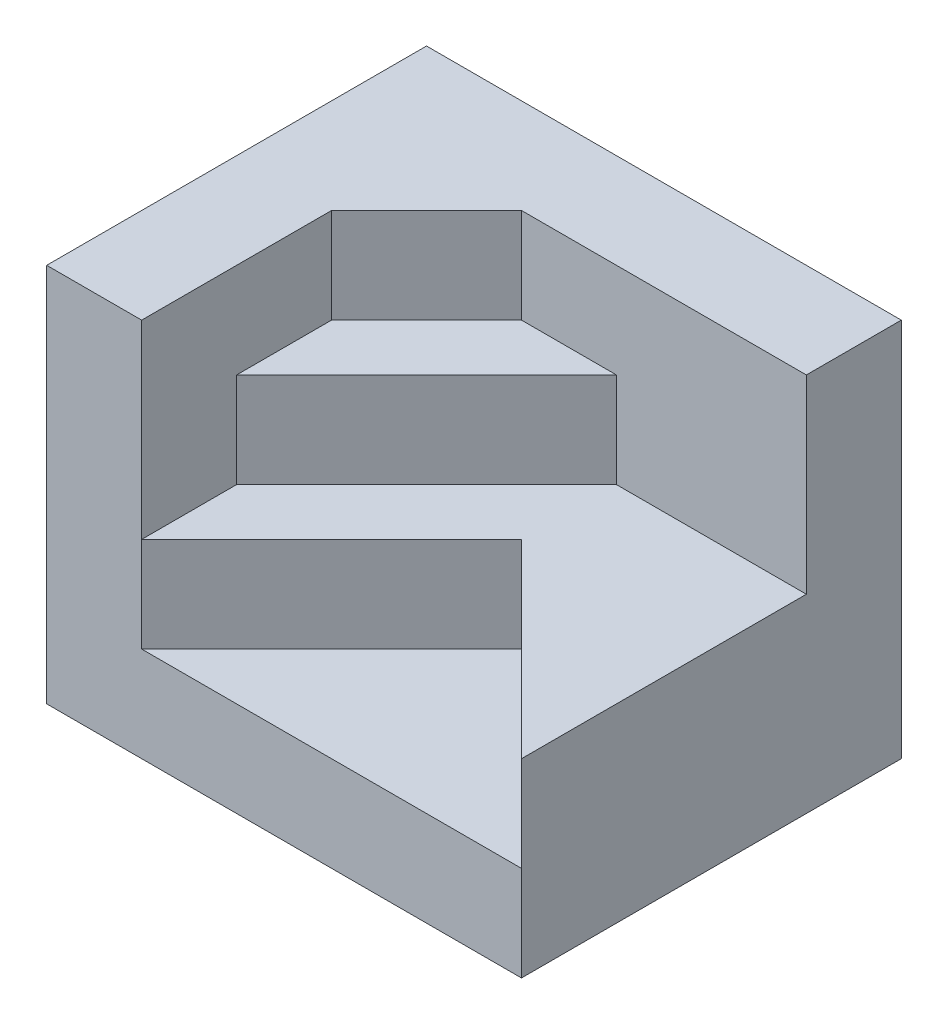
ISO-10303-21;
HEADER;
FILE_DESCRIPTION(('STEP AP214'),'2;1');
FILE_NAME('part.step','',(''),(''),'','','');
FILE_SCHEMA(('AUTOMOTIVE_DESIGN { 1 0 10303 214 1 1 1 1 }'));
ENDSEC;
DATA;
#1=APPLICATION_CONTEXT('core data for automotive mechanical design processes');
#2=APPLICATION_PROTOCOL_DEFINITION('international standard','automotive_design',2000,#1);
#3=PRODUCT_CONTEXT('',#1,'mechanical');
#4=PRODUCT('Part','Part','',(#3));
#5=PRODUCT_RELATED_PRODUCT_CATEGORY('part','',(#4));
#6=PRODUCT_DEFINITION_FORMATION('','',#4);
#7=PRODUCT_DEFINITION_CONTEXT('part definition',#1,'design');
#8=PRODUCT_DEFINITION('design','',#6,#7);
#9=PRODUCT_DEFINITION_SHAPE('','',#8);
#10=(LENGTH_UNIT() NAMED_UNIT(*) SI_UNIT(.MILLI.,.METRE.));
#11=(NAMED_UNIT(*) PLANE_ANGLE_UNIT() SI_UNIT($,.RADIAN.));
#12=(NAMED_UNIT(*) SI_UNIT($,.STERADIAN.) SOLID_ANGLE_UNIT());
#13=UNCERTAINTY_MEASURE_WITH_UNIT(LENGTH_MEASURE(1.E-05),#10,'distance_accuracy_value','');
#14=(GEOMETRIC_REPRESENTATION_CONTEXT(3) GLOBAL_UNCERTAINTY_ASSIGNED_CONTEXT((#13)) GLOBAL_UNIT_ASSIGNED_CONTEXT((#10,
#11,#12)) REPRESENTATION_CONTEXT('',''));
#15=CARTESIAN_POINT('',(0.,0.,0.));
#16=DIRECTION('',(0.,0.,1.));
#17=DIRECTION('',(1.,0.,0.));
#18=AXIS2_PLACEMENT_3D('',#15,#16,#17);
#19=CARTESIAN_POINT('',(-15.,184.372930440884,0.));
#20=DIRECTION('',(1.,0.,0.));
#21=DIRECTION('',(0.,0.,-1.));
#22=AXIS2_PLACEMENT_3D('',#19,#20,#21);
#23=PLANE('',#22);
#24=DIRECTION('',(0.,0.,-1.));
#25=VECTOR('',#24,1.);
#26=CARTESIAN_POINT('',(-15.,20.,0.));
#27=LINE('',#26,#25);
#28=CARTESIAN_POINT('',(-15.,20.,20.));
#29=VERTEX_POINT('',#28);
#30=CARTESIAN_POINT('',(-15.,20.,10.));
#31=VERTEX_POINT('',#30);
#32=EDGE_CURVE('E130',#29,#31,#27,.T.);
#33=ORIENTED_EDGE('',*,*,#32,.T.);
#34=DIRECTION('',(0.,-1.,0.));
#35=VECTOR('',#34,1.);
#36=CARTESIAN_POINT('',(-15.,30.,10.));
#37=LINE('',#36,#35);
#38=CARTESIAN_POINT('',(-15.,30.,10.));
#39=VERTEX_POINT('',#38);
#40=EDGE_CURVE('E47',#39,#31,#37,.T.);
#41=ORIENTED_EDGE('',*,*,#40,.F.);
#42=DIRECTION('',(0.,0.,-1.));
#43=VECTOR('',#42,1.);
#44=CARTESIAN_POINT('',(-15.,30.,10.));
#45=LINE('',#44,#43);
#46=CARTESIAN_POINT('',(-15.,30.,0.));
#47=VERTEX_POINT('',#46);
#48=EDGE_CURVE('E52',#39,#47,#45,.T.);
#49=ORIENTED_EDGE('',*,*,#48,.T.);
#50=DIRECTION('',(0.,-1.,0.));
#51=VECTOR('',#50,1.);
#52=CARTESIAN_POINT('',(-15.,184.372930440884,0.));
#53=LINE('',#52,#51);
#54=CARTESIAN_POINT('',(-15.,40.,0.));
#55=VERTEX_POINT('',#54);
#56=EDGE_CURVE('E167',#55,#47,#53,.T.);
#57=ORIENTED_EDGE('',*,*,#56,.F.);
#58=DIRECTION('',(0.,0.,-1.));
#59=VECTOR('',#58,1.);
#60=CARTESIAN_POINT('',(-15.,40.,0.));
#61=LINE('',#60,#59);
#62=CARTESIAN_POINT('',(-15.,40.,20.));
#63=VERTEX_POINT('',#62);
#64=EDGE_CURVE('E153',#63,#55,#61,.T.);
#65=ORIENTED_EDGE('',*,*,#64,.F.);
#66=DIRECTION('',(0.,-1.,0.));
#67=VECTOR('',#66,1.);
#68=CARTESIAN_POINT('',(-15.,184.372930440884,20.));
#69=LINE('',#68,#67);
#70=EDGE_CURVE('E164',#63,#29,#69,.T.);
#71=ORIENTED_EDGE('',*,*,#70,.T.);
#72=EDGE_LOOP('',(#33,#41,#49,#57,#65,#71));
#73=FACE_BOUND('',#72,.T.);
#74=ADVANCED_FACE('F32',(#73),#23,.T.);
#75=CARTESIAN_POINT('',(-5.00000000000001,184.372930440884,-10.));
#76=DIRECTION('',(0.707106781186548,0.,0.707106781186547));
#77=DIRECTION('',(0.707106781186547,0.,-0.707106781186548));
#78=AXIS2_PLACEMENT_3D('',#75,#76,#77);
#79=PLANE('',#78);
#80=ORIENTED_EDGE('',*,*,#56,.T.);
#81=DIRECTION('',(0.707106781186547,0.,-0.707106781186548));
#82=VECTOR('',#81,1.);
#83=CARTESIAN_POINT('',(-15.,30.,0.));
#84=LINE('',#83,#82);
#85=CARTESIAN_POINT('',(-5.00000000000001,30.,-10.));
#86=VERTEX_POINT('',#85);
#87=EDGE_CURVE('E252',#47,#86,#84,.T.);
#88=ORIENTED_EDGE('',*,*,#87,.T.);
#89=DIRECTION('',(0.,-1.,0.));
#90=VECTOR('',#89,1.);
#91=CARTESIAN_POINT('',(-5.00000000000001,184.372930440884,-10.));
#92=LINE('',#91,#90);
#93=CARTESIAN_POINT('',(-5.00000000000001,40.,-10.));
#94=VERTEX_POINT('',#93);
#95=EDGE_CURVE('E162',#94,#86,#92,.T.);
#96=ORIENTED_EDGE('',*,*,#95,.F.);
#97=DIRECTION('',(0.707106781186547,0.,-0.707106781186548));
#98=VECTOR('',#97,1.);
#99=CARTESIAN_POINT('',(-5.00000000000001,40.,-10.));
#100=LINE('',#99,#98);
#101=EDGE_CURVE('E156',#55,#94,#100,.T.);
#102=ORIENTED_EDGE('',*,*,#101,.F.);
#103=EDGE_LOOP('',(#80,#88,#96,#102));
#104=FACE_BOUND('',#103,.T.);
#105=ADVANCED_FACE('F250',(#104),#79,.T.);
#106=CARTESIAN_POINT('',(25.,184.372930440884,-10.));
#107=DIRECTION('',(0.,0.,1.));
#108=DIRECTION('',(1.,0.,0.));
#109=AXIS2_PLACEMENT_3D('',#106,#107,#108);
#110=PLANE('',#109);
#111=DIRECTION('',(1.,0.,0.));
#112=VECTOR('',#111,1.);
#113=CARTESIAN_POINT('',(-5.00000000000001,30.,-10.));
#114=LINE('',#113,#112);
#115=CARTESIAN_POINT('',(4.99999999999999,30.,-10.));
#116=VERTEX_POINT('',#115);
#117=EDGE_CURVE('E138',#86,#116,#114,.T.);
#118=ORIENTED_EDGE('',*,*,#117,.T.);
#119=DIRECTION('',(0.,-1.,0.));
#120=VECTOR('',#119,1.);
#121=CARTESIAN_POINT('',(4.99999999999999,30.,-10.));
#122=LINE('',#121,#120);
#123=CARTESIAN_POINT('',(4.99999999999999,20.,-10.));
#124=VERTEX_POINT('',#123);
#125=EDGE_CURVE('E134',#116,#124,#122,.T.);
#126=ORIENTED_EDGE('',*,*,#125,.T.);
#127=DIRECTION('',(1.,0.,0.));
#128=VECTOR('',#127,1.);
#129=CARTESIAN_POINT('',(25.,20.,-10.));
#130=LINE('',#129,#128);
#131=CARTESIAN_POINT('',(25.,20.,-10.));
#132=VERTEX_POINT('',#131);
#133=EDGE_CURVE('E121',#124,#132,#130,.T.);
#134=ORIENTED_EDGE('',*,*,#133,.T.);
#135=DIRECTION('',(0.,-1.,0.));
#136=VECTOR('',#135,1.);
#137=CARTESIAN_POINT('',(25.,184.372930440884,-10.));
#138=LINE('',#137,#136);
#139=CARTESIAN_POINT('',(25.,40.,-10.));
#140=VERTEX_POINT('',#139);
#141=EDGE_CURVE('E151',#140,#132,#138,.T.);
#142=ORIENTED_EDGE('',*,*,#141,.F.);
#143=DIRECTION('',(1.,0.,0.));
#144=VECTOR('',#143,1.);
#145=CARTESIAN_POINT('',(25.,40.,-10.));
#146=LINE('',#145,#144);
#147=EDGE_CURVE('E131',#94,#140,#146,.T.);
#148=ORIENTED_EDGE('',*,*,#147,.F.);
#149=ORIENTED_EDGE('',*,*,#95,.T.);
#150=EDGE_LOOP('',(#118,#126,#134,#142,#148,#149));
#151=FACE_BOUND('',#150,.T.);
#152=ADVANCED_FACE('F135',(#151),#110,.T.);
#153=CARTESIAN_POINT('',(0.,20.,0.));
#154=DIRECTION('',(0.,-1.,0.));
#155=DIRECTION('',(0.,0.,-1.));
#156=AXIS2_PLACEMENT_3D('',#153,#154,#155);
#157=PLANE('',#156);
#158=DIRECTION('',(0.707106781186548,0.,-0.707106781186547));
#159=VECTOR('',#158,1.);
#160=CARTESIAN_POINT('',(-15.,20.,10.));
#161=LINE('',#160,#159);
#162=EDGE_CURVE('E125',#31,#124,#161,.T.);
#163=ORIENTED_EDGE('',*,*,#162,.F.);
#164=ORIENTED_EDGE('',*,*,#32,.F.);
#165=DIRECTION('',(-0.707106781186548,0.,0.707106781186548));
#166=VECTOR('',#165,1.);
#167=CARTESIAN_POINT('',(4.99999999999999,20.,0.));
#168=LINE('',#167,#166);
#169=CARTESIAN_POINT('',(4.99999999999999,20.,0.));
#170=VERTEX_POINT('',#169);
#171=EDGE_CURVE('E141',#170,#29,#168,.T.);
#172=ORIENTED_EDGE('',*,*,#171,.F.);
#173=DIRECTION('',(-0.707106781186548,0.,-0.707106781186547));
#174=VECTOR('',#173,1.);
#175=CARTESIAN_POINT('',(25.,20.,20.));
#176=LINE('',#175,#174);
#177=CARTESIAN_POINT('',(25.,20.,20.));
#178=VERTEX_POINT('',#177);
#179=EDGE_CURVE('E172',#178,#170,#176,.T.);
#180=ORIENTED_EDGE('',*,*,#179,.F.);
#181=DIRECTION('',(0.,0.,-1.));
#182=VECTOR('',#181,1.);
#183=CARTESIAN_POINT('',(25.,20.,20.));
#184=LINE('',#183,#182);
#185=EDGE_CURVE('E127',#178,#132,#184,.T.);
#186=ORIENTED_EDGE('',*,*,#185,.T.);
#187=ORIENTED_EDGE('',*,*,#133,.F.);
#188=EDGE_LOOP('',(#163,#164,#172,#180,#186,#187));
#189=FACE_BOUND('',#188,.T.);
#190=ADVANCED_FACE('F123',(#189),#157,.F.);
#191=CARTESIAN_POINT('',(25.,40.,20.));
#192=DIRECTION('',(-1.,0.,0.));
#193=DIRECTION('',(0.,0.,1.));
#194=AXIS2_PLACEMENT_3D('',#191,#192,#193);
#195=PLANE('',#194);
#196=ORIENTED_EDGE('',*,*,#141,.T.);
#197=ORIENTED_EDGE('',*,*,#185,.F.);
#198=DIRECTION('',(0.,-1.,0.));
#199=VECTOR('',#198,1.);
#200=CARTESIAN_POINT('',(25.,40.,20.));
#201=LINE('',#200,#199);
#202=CARTESIAN_POINT('',(25.,10.,20.));
#203=VERTEX_POINT('',#202);
#204=EDGE_CURVE('E210',#178,#203,#201,.T.);
#205=ORIENTED_EDGE('',*,*,#204,.T.);
#206=CARTESIAN_POINT('',(25.,0.,20.));
#207=VERTEX_POINT('',#206);
#208=EDGE_CURVE('E201',#203,#207,#201,.T.);
#209=ORIENTED_EDGE('',*,*,#208,.T.);
#210=DIRECTION('',(0.,0.,-1.));
#211=VECTOR('',#210,1.);
#212=CARTESIAN_POINT('',(25.,0.,20.));
#213=LINE('',#212,#211);
#214=CARTESIAN_POINT('',(25.,0.,-20.));
#215=VERTEX_POINT('',#214);
#216=EDGE_CURVE('E188',#207,#215,#213,.T.);
#217=ORIENTED_EDGE('',*,*,#216,.T.);
#218=DIRECTION('',(0.,-1.,0.));
#219=VECTOR('',#218,1.);
#220=CARTESIAN_POINT('',(25.,40.,-20.));
#221=LINE('',#220,#219);
#222=CARTESIAN_POINT('',(25.,40.,-20.));
#223=VERTEX_POINT('',#222);
#224=EDGE_CURVE('E11',#223,#215,#221,.T.);
#225=ORIENTED_EDGE('',*,*,#224,.F.);
#226=DIRECTION('',(0.,0.,-1.));
#227=VECTOR('',#226,1.);
#228=CARTESIAN_POINT('',(25.,40.,20.));
#229=LINE('',#228,#227);
#230=EDGE_CURVE('E191',#140,#223,#229,.T.);
#231=ORIENTED_EDGE('',*,*,#230,.F.);
#232=EDGE_LOOP('',(#196,#197,#205,#209,#217,#225,#231));
#233=FACE_BOUND('',#232,.T.);
#234=ADVANCED_FACE('F34',(#233),#195,.F.);
#235=CARTESIAN_POINT('',(0.,40.,0.));
#236=DIRECTION('',(0.,-1.,0.));
#237=DIRECTION('',(0.,0.,-1.));
#238=AXIS2_PLACEMENT_3D('',#235,#236,#237);
#239=PLANE('',#238);
#240=ORIENTED_EDGE('',*,*,#64,.T.);
#241=ORIENTED_EDGE('',*,*,#101,.T.);
#242=ORIENTED_EDGE('',*,*,#147,.T.);
#243=ORIENTED_EDGE('',*,*,#230,.T.);
#244=DIRECTION('',(-1.,0.,0.));
#245=VECTOR('',#244,1.);
#246=CARTESIAN_POINT('',(-25.,40.,-20.));
#247=LINE('',#246,#245);
#248=CARTESIAN_POINT('',(-25.,40.,-20.));
#249=VERTEX_POINT('',#248);
#250=EDGE_CURVE('E193',#223,#249,#247,.T.);
#251=ORIENTED_EDGE('',*,*,#250,.T.);
#252=DIRECTION('',(0.,0.,1.));
#253=VECTOR('',#252,1.);
#254=CARTESIAN_POINT('',(-25.,40.,20.));
#255=LINE('',#254,#253);
#256=CARTESIAN_POINT('',(-25.,40.,20.));
#257=VERTEX_POINT('',#256);
#258=EDGE_CURVE('E196',#249,#257,#255,.T.);
#259=ORIENTED_EDGE('',*,*,#258,.T.);
#260=DIRECTION('',(1.,0.,0.));
#261=VECTOR('',#260,1.);
#262=CARTESIAN_POINT('',(-25.,40.,20.));
#263=LINE('',#262,#261);
#264=EDGE_CURVE('E198',#257,#63,#263,.T.);
#265=ORIENTED_EDGE('',*,*,#264,.T.);
#266=EDGE_LOOP('',(#240,#241,#242,#243,#251,#259,#265));
#267=FACE_BOUND('',#266,.T.);
#268=ADVANCED_FACE('F234',(#267),#239,.F.);
#269=CARTESIAN_POINT('',(-25.,40.,-20.));
#270=DIRECTION('',(0.,0.,1.));
#271=DIRECTION('',(1.,0.,0.));
#272=AXIS2_PLACEMENT_3D('',#269,#270,#271);
#273=PLANE('',#272);
#274=DIRECTION('',(-1.,0.,0.));
#275=VECTOR('',#274,1.);
#276=CARTESIAN_POINT('',(-25.,0.,-20.));
#277=LINE('',#276,#275);
#278=CARTESIAN_POINT('',(-25.,0.,-20.));
#279=VERTEX_POINT('',#278);
#280=EDGE_CURVE('E204',#215,#279,#277,.T.);
#281=ORIENTED_EDGE('',*,*,#280,.T.);
#282=DIRECTION('',(0.,-1.,0.));
#283=VECTOR('',#282,1.);
#284=CARTESIAN_POINT('',(-25.,40.,-20.));
#285=LINE('',#284,#283);
#286=EDGE_CURVE('E40',#249,#279,#285,.T.);
#287=ORIENTED_EDGE('',*,*,#286,.F.);
#288=ORIENTED_EDGE('',*,*,#250,.F.);
#289=ORIENTED_EDGE('',*,*,#224,.T.);
#290=EDGE_LOOP('',(#281,#287,#288,#289));
#291=FACE_BOUND('',#290,.T.);
#292=ADVANCED_FACE('F237',(#291),#273,.F.);
#293=CARTESIAN_POINT('',(-25.,40.,20.));
#294=DIRECTION('',(1.,0.,0.));
#295=DIRECTION('',(0.,0.,-1.));
#296=AXIS2_PLACEMENT_3D('',#293,#294,#295);
#297=PLANE('',#296);
#298=DIRECTION('',(0.,0.,1.));
#299=VECTOR('',#298,1.);
#300=CARTESIAN_POINT('',(-25.,0.,20.));
#301=LINE('',#300,#299);
#302=CARTESIAN_POINT('',(-25.,0.,20.));
#303=VERTEX_POINT('',#302);
#304=EDGE_CURVE('E206',#279,#303,#301,.T.);
#305=ORIENTED_EDGE('',*,*,#304,.T.);
#306=DIRECTION('',(0.,-1.,0.));
#307=VECTOR('',#306,1.);
#308=CARTESIAN_POINT('',(-25.,40.,20.));
#309=LINE('',#308,#307);
#310=EDGE_CURVE('E212',#257,#303,#309,.T.);
#311=ORIENTED_EDGE('',*,*,#310,.F.);
#312=ORIENTED_EDGE('',*,*,#258,.F.);
#313=ORIENTED_EDGE('',*,*,#286,.T.);
#314=EDGE_LOOP('',(#305,#311,#312,#313));
#315=FACE_BOUND('',#314,.T.);
#316=ADVANCED_FACE('F219',(#315),#297,.F.);
#317=CARTESIAN_POINT('',(-25.,40.,20.));
#318=DIRECTION('',(0.,0.,-1.));
#319=DIRECTION('',(-1.,0.,0.));
#320=AXIS2_PLACEMENT_3D('',#317,#318,#319);
#321=PLANE('',#320);
#322=DIRECTION('',(1.,0.,0.));
#323=VECTOR('',#322,1.);
#324=CARTESIAN_POINT('',(-15.,10.,20.));
#325=LINE('',#324,#323);
#326=CARTESIAN_POINT('',(-15.,10.,20.));
#327=VERTEX_POINT('',#326);
#328=EDGE_CURVE('E169',#327,#203,#325,.T.);
#329=ORIENTED_EDGE('',*,*,#328,.F.);
#330=DIRECTION('',(0.,1.,0.));
#331=VECTOR('',#330,1.);
#332=CARTESIAN_POINT('',(-15.,10.,20.));
#333=LINE('',#332,#331);
#334=EDGE_CURVE('E185',#327,#29,#333,.T.);
#335=ORIENTED_EDGE('',*,*,#334,.T.);
#336=ORIENTED_EDGE('',*,*,#70,.F.);
#337=ORIENTED_EDGE('',*,*,#264,.F.);
#338=ORIENTED_EDGE('',*,*,#310,.T.);
#339=DIRECTION('',(1.,0.,0.));
#340=VECTOR('',#339,1.);
#341=CARTESIAN_POINT('',(-25.,0.,20.));
#342=LINE('',#341,#340);
#343=EDGE_CURVE('E194',#303,#207,#342,.T.);
#344=ORIENTED_EDGE('',*,*,#343,.T.);
#345=ORIENTED_EDGE('',*,*,#208,.F.);
#346=EDGE_LOOP('',(#329,#335,#336,#337,#338,#344,#345));
#347=FACE_BOUND('',#346,.T.);
#348=ADVANCED_FACE('F230',(#347),#321,.F.);
#349=CARTESIAN_POINT('',(0.,0.,0.));
#350=DIRECTION('',(0.,-1.,0.));
#351=DIRECTION('',(0.,0.,-1.));
#352=AXIS2_PLACEMENT_3D('',#349,#350,#351);
#353=PLANE('',#352);
#354=ORIENTED_EDGE('',*,*,#216,.F.);
#355=ORIENTED_EDGE('',*,*,#343,.F.);
#356=ORIENTED_EDGE('',*,*,#304,.F.);
#357=ORIENTED_EDGE('',*,*,#280,.F.);
#358=EDGE_LOOP('',(#354,#355,#356,#357));
#359=FACE_BOUND('',#358,.T.);
#360=ADVANCED_FACE('F226',(#359),#353,.T.);
#361=CARTESIAN_POINT('',(4.99999999999999,10.,0.));
#362=DIRECTION('',(-0.707106781186547,0.,-0.707106781186547));
#363=DIRECTION('',(-0.707106781186548,0.,0.707106781186548));
#364=AXIS2_PLACEMENT_3D('',#361,#362,#363);
#365=PLANE('',#364);
#366=DIRECTION('',(0.,1.,0.));
#367=VECTOR('',#366,1.);
#368=CARTESIAN_POINT('',(4.99999999999999,10.,0.));
#369=LINE('',#368,#367);
#370=CARTESIAN_POINT('',(4.99999999999999,10.,0.));
#371=VERTEX_POINT('',#370);
#372=EDGE_CURVE('E184',#371,#170,#369,.T.);
#373=ORIENTED_EDGE('',*,*,#372,.T.);
#374=ORIENTED_EDGE('',*,*,#171,.T.);
#375=ORIENTED_EDGE('',*,*,#334,.F.);
#376=DIRECTION('',(-0.707106781186548,0.,0.707106781186548));
#377=VECTOR('',#376,1.);
#378=CARTESIAN_POINT('',(4.99999999999999,10.,0.));
#379=LINE('',#378,#377);
#380=EDGE_CURVE('E181',#371,#327,#379,.T.);
#381=ORIENTED_EDGE('',*,*,#380,.F.);
#382=EDGE_LOOP('',(#373,#374,#375,#381));
#383=FACE_BOUND('',#382,.T.);
#384=ADVANCED_FACE('F247',(#383),#365,.F.);
#385=CARTESIAN_POINT('',(25.,10.,20.));
#386=DIRECTION('',(0.707106781186547,0.,-0.707106781186548));
#387=DIRECTION('',(-0.707106781186548,0.,-0.707106781186547));
#388=AXIS2_PLACEMENT_3D('',#385,#386,#387);
#389=PLANE('',#388);
#390=ORIENTED_EDGE('',*,*,#204,.F.);
#391=ORIENTED_EDGE('',*,*,#179,.T.);
#392=ORIENTED_EDGE('',*,*,#372,.F.);
#393=DIRECTION('',(-0.707106781186548,0.,-0.707106781186547));
#394=VECTOR('',#393,1.);
#395=CARTESIAN_POINT('',(25.,10.,20.));
#396=LINE('',#395,#394);
#397=EDGE_CURVE('E178',#203,#371,#396,.T.);
#398=ORIENTED_EDGE('',*,*,#397,.F.);
#399=EDGE_LOOP('',(#390,#391,#392,#398));
#400=FACE_BOUND('',#399,.T.);
#401=ADVANCED_FACE('F242',(#400),#389,.F.);
#402=CARTESIAN_POINT('',(0.,10.,0.));
#403=DIRECTION('',(0.,1.,0.));
#404=DIRECTION('',(0.,0.,1.));
#405=AXIS2_PLACEMENT_3D('',#402,#403,#404);
#406=PLANE('',#405);
#407=ORIENTED_EDGE('',*,*,#328,.T.);
#408=ORIENTED_EDGE('',*,*,#397,.T.);
#409=ORIENTED_EDGE('',*,*,#380,.T.);
#410=EDGE_LOOP('',(#407,#408,#409));
#411=FACE_BOUND('',#410,.T.);
#412=ADVANCED_FACE('F245',(#411),#406,.T.);
#413=CARTESIAN_POINT('',(-15.,30.,10.));
#414=DIRECTION('',(-0.707106781186547,0.,-0.707106781186548));
#415=DIRECTION('',(-0.707106781186548,0.,0.707106781186547));
#416=AXIS2_PLACEMENT_3D('',#413,#414,#415);
#417=PLANE('',#416);
#418=ORIENTED_EDGE('',*,*,#162,.T.);
#419=ORIENTED_EDGE('',*,*,#125,.F.);
#420=DIRECTION('',(0.707106781186548,0.,-0.707106781186547));
#421=VECTOR('',#420,1.);
#422=CARTESIAN_POINT('',(-15.,30.,10.));
#423=LINE('',#422,#421);
#424=EDGE_CURVE('E144',#39,#116,#423,.T.);
#425=ORIENTED_EDGE('',*,*,#424,.F.);
#426=ORIENTED_EDGE('',*,*,#40,.T.);
#427=EDGE_LOOP('',(#418,#419,#425,#426));
#428=FACE_BOUND('',#427,.T.);
#429=ADVANCED_FACE('F143',(#428),#417,.F.);
#430=CARTESIAN_POINT('',(0.,30.,0.));
#431=DIRECTION('',(0.,-1.,0.));
#432=DIRECTION('',(0.,0.,-1.));
#433=AXIS2_PLACEMENT_3D('',#430,#431,#432);
#434=PLANE('',#433);
#435=ORIENTED_EDGE('',*,*,#424,.T.);
#436=ORIENTED_EDGE('',*,*,#117,.F.);
#437=ORIENTED_EDGE('',*,*,#87,.F.);
#438=ORIENTED_EDGE('',*,*,#48,.F.);
#439=EDGE_LOOP('',(#435,#436,#437,#438));
#440=FACE_BOUND('',#439,.T.);
#441=ADVANCED_FACE('F254',(#440),#434,.F.);
#442=CLOSED_SHELL('',(#74,#105,#152,#190,#234,#268,#292,#316,#348,#360,#384,#401,#412,#429,#441));
#443=MANIFOLD_SOLID_BREP('B2',#442);
#444=ADVANCED_BREP_SHAPE_REPRESENTATION('',(#18,#443),#14);
#445=SHAPE_DEFINITION_REPRESENTATION(#9,#444);
ENDSEC;
END-ISO-10303-21;
